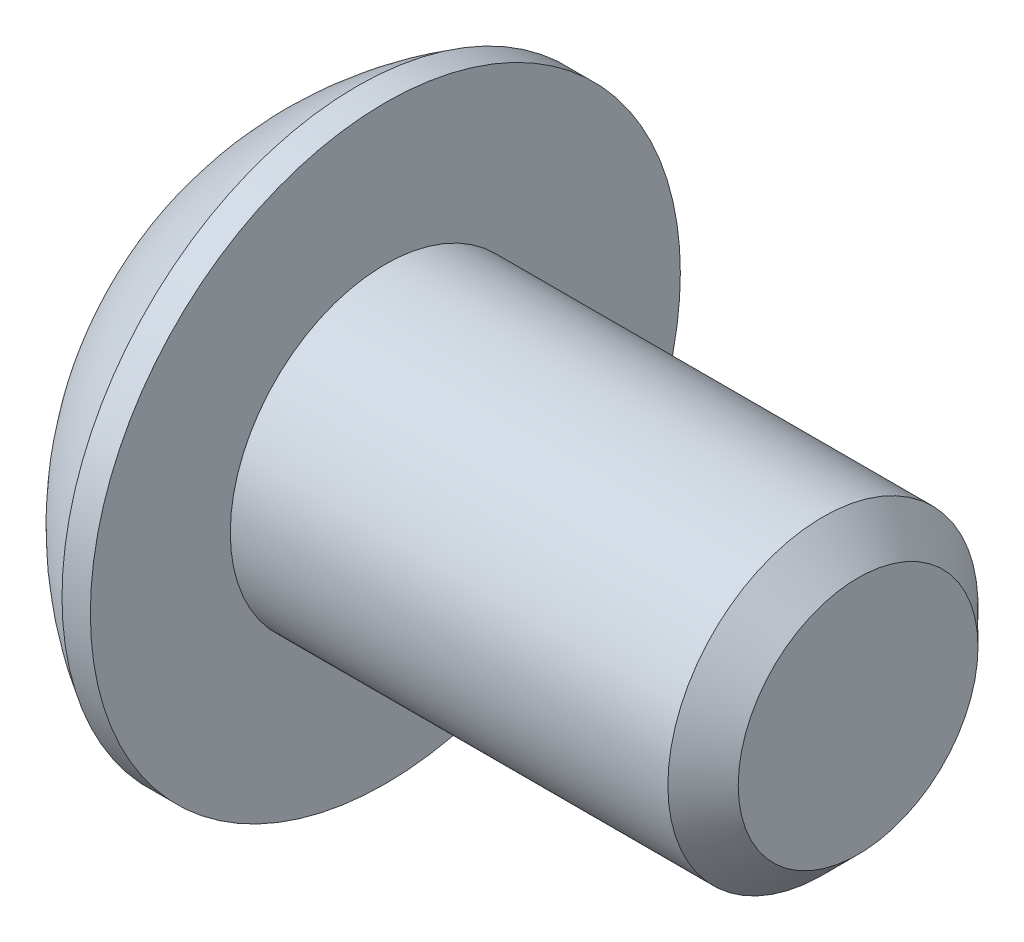
ISO-10303-21;
HEADER;
FILE_DESCRIPTION(('STEP AP214'),'2;1');
FILE_NAME('part.step','',(''),(''),'','','');
FILE_SCHEMA(('AUTOMOTIVE_DESIGN { 1 0 10303 214 1 1 1 1 }'));
ENDSEC;
DATA;
#1=APPLICATION_CONTEXT('core data for automotive mechanical design processes');
#2=APPLICATION_PROTOCOL_DEFINITION('international standard','automotive_design',2000,#1);
#3=PRODUCT_CONTEXT('',#1,'mechanical');
#4=PRODUCT('Part','Part','',(#3));
#5=PRODUCT_RELATED_PRODUCT_CATEGORY('part','',(#4));
#6=PRODUCT_DEFINITION_FORMATION('','',#4);
#7=PRODUCT_DEFINITION_CONTEXT('part definition',#1,'design');
#8=PRODUCT_DEFINITION('design','',#6,#7);
#9=PRODUCT_DEFINITION_SHAPE('','',#8);
#10=(LENGTH_UNIT() NAMED_UNIT(*) SI_UNIT(.MILLI.,.METRE.));
#11=(NAMED_UNIT(*) PLANE_ANGLE_UNIT() SI_UNIT($,.RADIAN.));
#12=(NAMED_UNIT(*) SI_UNIT($,.STERADIAN.) SOLID_ANGLE_UNIT());
#13=UNCERTAINTY_MEASURE_WITH_UNIT(LENGTH_MEASURE(1.E-05),#10,'distance_accuracy_value','');
#14=(GEOMETRIC_REPRESENTATION_CONTEXT(3) GLOBAL_UNCERTAINTY_ASSIGNED_CONTEXT((#13)) GLOBAL_UNIT_ASSIGNED_CONTEXT((#10,
#11,#12)) REPRESENTATION_CONTEXT('',''));
#15=CARTESIAN_POINT('',(0.,0.,0.));
#16=DIRECTION('',(0.,0.,1.));
#17=DIRECTION('',(1.,0.,0.));
#18=AXIS2_PLACEMENT_3D('',#15,#16,#17);
#19=CARTESIAN_POINT('',(8.5598,0.,0.));
#20=DIRECTION('',(-1.,0.,0.));
#21=DIRECTION('',(0.,0.,1.));
#22=AXIS2_PLACEMENT_3D('',#19,#20,#21);
#23=PLANE('',#22);
#24=CARTESIAN_POINT('',(8.55980000005729,0.,0.));
#25=DIRECTION('',(-1.,0.,0.));
#26=DIRECTION('',(0.,0.,1.));
#27=AXIS2_PLACEMENT_3D('',#24,#25,#26);
#28=CIRCLE('',#27,1.61035999997239);
#29=CARTESIAN_POINT('',(8.55980000005729,0.,1.61035999997239));
#30=VERTEX_POINT('',#29);
#31=EDGE_CURVE('E21',#30,#30,#28,.T.);
#32=ORIENTED_EDGE('',*,*,#31,.F.);
#33=EDGE_LOOP('',(#32));
#34=FACE_BOUND('',#33,.T.);
#35=ADVANCED_FACE('F17',(#34),#23,.F.);
#36=CARTESIAN_POINT('',(8.08736000004728,0.,0.));
#37=DIRECTION('',(-1.,0.,0.));
#38=DIRECTION('',(0.,0.,1.));
#39=AXIS2_PLACEMENT_3D('',#36,#37,#38);
#40=CONICAL_SURFACE('',#39,2.0827999999824,0.785398163397448);
#41=ORIENTED_EDGE('',*,*,#31,.T.);
#42=EDGE_LOOP('',(#41));
#43=FACE_BOUND('',#42,.T.);
#44=CARTESIAN_POINT('',(8.08736000000001,0.,0.));
#45=DIRECTION('',(-1.,0.,0.));
#46=DIRECTION('',(0.,0.,1.));
#47=AXIS2_PLACEMENT_3D('',#44,#45,#46);
#48=CIRCLE('',#47,2.0828);
#49=CARTESIAN_POINT('',(8.08736000000001,0.,2.0828));
#50=VERTEX_POINT('',#49);
#51=EDGE_CURVE('E109',#50,#50,#48,.T.);
#52=ORIENTED_EDGE('',*,*,#51,.F.);
#53=EDGE_LOOP('',(#52));
#54=FACE_BOUND('',#53,.T.);
#55=ADVANCED_FACE('F311',(#43,#54),#40,.T.);
#56=CARTESIAN_POINT('',(1.32079999997359,0.,0.));
#57=DIRECTION('',(-1.,0.,0.));
#58=DIRECTION('',(0.,0.,1.));
#59=AXIS2_PLACEMENT_3D('',#56,#57,#58);
#60=CONICAL_SURFACE('',#59,1.19380000001001,1.04719755119008);
#61=CARTESIAN_POINT('',(2.0100407513155,0.,0.));
#62=VERTEX_POINT('',#61);
#63=VERTEX_LOOP('',#62);
#64=FACE_BOUND('',#63,.T.);
#65=CARTESIAN_POINT('',(1.32079999997359,0.,0.));
#66=DIRECTION('',(-1.,0.,0.));
#67=DIRECTION('',(0.,0.,1.));
#68=AXIS2_PLACEMENT_3D('',#65,#66,#67);
#69=CIRCLE('',#68,1.19380000001001);
#70=CARTESIAN_POINT('',(1.32079999998682,-1.0338611270422,0.596900000002503));
#71=VERTEX_POINT('',#70);
#72=CARTESIAN_POINT('',(1.32079999998682,0.,1.19380000000501));
#73=VERTEX_POINT('',#72);
#74=EDGE_CURVE('E94',#71,#73,#69,.T.);
#75=ORIENTED_EDGE('',*,*,#74,.T.);
#76=CARTESIAN_POINT('',(1.32079999997359,0.,0.));
#77=DIRECTION('',(-1.,0.,0.));
#78=DIRECTION('',(0.,0.,1.));
#79=AXIS2_PLACEMENT_3D('',#76,#77,#78);
#80=CIRCLE('',#79,1.19380000001001);
#81=CARTESIAN_POINT('',(1.32079999998682,1.0338611270422,0.596900000002504));
#82=VERTEX_POINT('',#81);
#83=EDGE_CURVE('E88',#73,#82,#80,.T.);
#84=ORIENTED_EDGE('',*,*,#83,.T.);
#85=CARTESIAN_POINT('',(1.32079999997359,0.,0.));
#86=DIRECTION('',(-1.,0.,0.));
#87=DIRECTION('',(0.,0.,1.));
#88=AXIS2_PLACEMENT_3D('',#85,#86,#87);
#89=CIRCLE('',#88,1.19380000001001);
#90=CARTESIAN_POINT('',(1.32079999998682,1.0338611270422,-0.596900000002504));
#91=VERTEX_POINT('',#90);
#92=EDGE_CURVE('E91',#82,#91,#89,.T.);
#93=ORIENTED_EDGE('',*,*,#92,.T.);
#94=CARTESIAN_POINT('',(1.32079999997359,0.,0.));
#95=DIRECTION('',(-1.,0.,0.));
#96=DIRECTION('',(0.,0.,1.));
#97=AXIS2_PLACEMENT_3D('',#94,#95,#96);
#98=CIRCLE('',#97,1.19380000001001);
#99=CARTESIAN_POINT('',(1.32079999998682,1.49461108489558E-12,-1.19380000000501));
#100=VERTEX_POINT('',#99);
#101=EDGE_CURVE('E153',#91,#100,#98,.T.);
#102=ORIENTED_EDGE('',*,*,#101,.T.);
#103=CARTESIAN_POINT('',(1.32079999997359,0.,0.));
#104=DIRECTION('',(-1.,0.,0.));
#105=DIRECTION('',(0.,0.,1.));
#106=AXIS2_PLACEMENT_3D('',#103,#104,#105);
#107=CIRCLE('',#106,1.19380000001001);
#108=CARTESIAN_POINT('',(1.32079999998682,-1.0338611270422,-0.596900000002503));
#109=VERTEX_POINT('',#108);
#110=EDGE_CURVE('E155',#100,#109,#107,.T.);
#111=ORIENTED_EDGE('',*,*,#110,.T.);
#112=CARTESIAN_POINT('',(1.32079999997359,0.,0.));
#113=DIRECTION('',(-1.,0.,0.));
#114=DIRECTION('',(0.,0.,1.));
#115=AXIS2_PLACEMENT_3D('',#112,#113,#114);
#116=CIRCLE('',#115,1.19380000001001);
#117=EDGE_CURVE('E157',#109,#71,#116,.T.);
#118=ORIENTED_EDGE('',*,*,#117,.T.);
#119=EDGE_LOOP('',(#75,#84,#93,#102,#111,#118));
#120=FACE_BOUND('',#119,.T.);
#121=ADVANCED_FACE('F90',(#64,#120),#60,.F.);
#122=CARTESIAN_POINT('',(0.,0.,0.));
#123=DIRECTION('',(-1.,0.,0.));
#124=DIRECTION('',(0.,0.,1.));
#125=AXIS2_PLACEMENT_3D('',#122,#123,#124);
#126=CYLINDRICAL_SURFACE('',#125,2.0828);
#127=ORIENTED_EDGE('',*,*,#51,.T.);
#128=EDGE_LOOP('',(#127));
#129=FACE_BOUND('',#128,.T.);
#130=CARTESIAN_POINT('',(2.2098,0.,0.));
#131=DIRECTION('',(-1.,0.,0.));
#132=DIRECTION('',(0.,0.,1.));
#133=AXIS2_PLACEMENT_3D('',#130,#131,#132);
#134=CIRCLE('',#133,2.0828);
#135=CARTESIAN_POINT('',(2.2098,0.,2.0828));
#136=VERTEX_POINT('',#135);
#137=EDGE_CURVE('E150',#136,#136,#134,.F.);
#138=ORIENTED_EDGE('',*,*,#137,.T.);
#139=EDGE_LOOP('',(#138));
#140=FACE_BOUND('',#139,.T.);
#141=ADVANCED_FACE('F302',(#129,#140),#126,.T.);
#142=CARTESIAN_POINT('',(1.3208,-2.06772225407572,-1.1938));
#143=DIRECTION('',(1.,0.,0.));
#144=DIRECTION('',(0.,0.,-1.));
#145=AXIS2_PLACEMENT_3D('',#142,#143,#144);
#146=PLANE('',#145);
#147=DIRECTION('',(0.,-0.5,-0.866025403784439));
#148=VECTOR('',#147,1.);
#149=CARTESIAN_POINT('',(1.32080000000004,1.37848150271715,0.));
#150=LINE('',#149,#148);
#151=CARTESIAN_POINT('',(1.32080000000001,1.37848150271715,0.));
#152=VERTEX_POINT('',#151);
#153=EDGE_CURVE('E107',#91,#152,#150,.F.);
#154=ORIENTED_EDGE('',*,*,#153,.F.);
#155=ORIENTED_EDGE('',*,*,#92,.F.);
#156=DIRECTION('',(0.,0.5,-0.866025403784439));
#157=VECTOR('',#156,1.);
#158=CARTESIAN_POINT('',(1.3208,0.689240751358576,1.1938));
#159=LINE('',#158,#157);
#160=EDGE_CURVE('E105',#152,#82,#159,.F.);
#161=ORIENTED_EDGE('',*,*,#160,.F.);
#162=EDGE_LOOP('',(#154,#155,#161));
#163=FACE_BOUND('',#162,.T.);
#164=ADVANCED_FACE('F103',(#163),#146,.F.);
#165=CARTESIAN_POINT('',(1.3208,-2.06772225407572,-1.1938));
#166=DIRECTION('',(1.,0.,0.));
#167=DIRECTION('',(0.,0.,-1.));
#168=AXIS2_PLACEMENT_3D('',#165,#166,#167);
#169=PLANE('',#168);
#170=DIRECTION('',(0.,0.5,-0.866025403784439));
#171=VECTOR('',#170,1.);
#172=CARTESIAN_POINT('',(1.32080000000004,0.689240751358576,1.1938));
#173=LINE('',#172,#171);
#174=CARTESIAN_POINT('',(1.32080000000001,0.689240751358576,1.1938));
#175=VERTEX_POINT('',#174);
#176=EDGE_CURVE('E110',#82,#175,#173,.F.);
#177=ORIENTED_EDGE('',*,*,#176,.F.);
#178=ORIENTED_EDGE('',*,*,#83,.F.);
#179=DIRECTION('',(0.,1.,0.));
#180=VECTOR('',#179,1.);
#181=CARTESIAN_POINT('',(1.3208,-0.689240751358574,1.1938));
#182=LINE('',#181,#180);
#183=EDGE_CURVE('E113',#175,#73,#182,.F.);
#184=ORIENTED_EDGE('',*,*,#183,.F.);
#185=EDGE_LOOP('',(#177,#178,#184));
#186=FACE_BOUND('',#185,.T.);
#187=ADVANCED_FACE('F111',(#186),#169,.F.);
#188=CARTESIAN_POINT('',(1.3208,-2.06772225407572,-1.1938));
#189=DIRECTION('',(1.,0.,0.));
#190=DIRECTION('',(0.,0.,-1.));
#191=AXIS2_PLACEMENT_3D('',#188,#189,#190);
#192=PLANE('',#191);
#193=DIRECTION('',(0.,1.,0.));
#194=VECTOR('',#193,1.);
#195=CARTESIAN_POINT('',(1.32080000000004,-0.689240751358574,1.1938));
#196=LINE('',#195,#194);
#197=CARTESIAN_POINT('',(1.32080000000001,-0.689240751358574,1.1938));
#198=VERTEX_POINT('',#197);
#199=EDGE_CURVE('E171',#73,#198,#196,.F.);
#200=ORIENTED_EDGE('',*,*,#199,.F.);
#201=ORIENTED_EDGE('',*,*,#74,.F.);
#202=DIRECTION('',(0.,0.5,0.866025403784439));
#203=VECTOR('',#202,1.);
#204=CARTESIAN_POINT('',(1.3208,-1.37848150271715,0.));
#205=LINE('',#204,#203);
#206=EDGE_CURVE('E169',#198,#71,#205,.F.);
#207=ORIENTED_EDGE('',*,*,#206,.F.);
#208=EDGE_LOOP('',(#200,#201,#207));
#209=FACE_BOUND('',#208,.T.);
#210=ADVANCED_FACE('F167',(#209),#192,.F.);
#211=CARTESIAN_POINT('',(1.3208,-2.06772225407572,-1.1938));
#212=DIRECTION('',(1.,0.,0.));
#213=DIRECTION('',(0.,0.,-1.));
#214=AXIS2_PLACEMENT_3D('',#211,#212,#213);
#215=PLANE('',#214);
#216=DIRECTION('',(0.,0.5,0.866025403784439));
#217=VECTOR('',#216,1.);
#218=CARTESIAN_POINT('',(1.32080000000004,-1.37848150271715,0.));
#219=LINE('',#218,#217);
#220=CARTESIAN_POINT('',(1.32080000000001,-1.37848150271715,0.));
#221=VERTEX_POINT('',#220);
#222=EDGE_CURVE('E172',#71,#221,#219,.F.);
#223=ORIENTED_EDGE('',*,*,#222,.F.);
#224=ORIENTED_EDGE('',*,*,#117,.F.);
#225=DIRECTION('',(0.,-0.5,0.866025403784439));
#226=VECTOR('',#225,1.);
#227=CARTESIAN_POINT('',(1.3208,-0.689240751358574,-1.1938));
#228=LINE('',#227,#226);
#229=EDGE_CURVE('E175',#221,#109,#228,.F.);
#230=ORIENTED_EDGE('',*,*,#229,.F.);
#231=EDGE_LOOP('',(#223,#224,#230));
#232=FACE_BOUND('',#231,.T.);
#233=ADVANCED_FACE('F173',(#232),#215,.F.);
#234=CARTESIAN_POINT('',(1.3208,-2.06772225407572,-1.1938));
#235=DIRECTION('',(1.,0.,0.));
#236=DIRECTION('',(0.,0.,-1.));
#237=AXIS2_PLACEMENT_3D('',#234,#235,#236);
#238=PLANE('',#237);
#239=DIRECTION('',(0.,-0.5,0.866025403784439));
#240=VECTOR('',#239,1.);
#241=CARTESIAN_POINT('',(1.32080000000004,-0.689240751358574,-1.1938));
#242=LINE('',#241,#240);
#243=CARTESIAN_POINT('',(1.32080000000001,-0.689240751358574,-1.1938));
#244=VERTEX_POINT('',#243);
#245=EDGE_CURVE('E230',#109,#244,#242,.F.);
#246=ORIENTED_EDGE('',*,*,#245,.F.);
#247=ORIENTED_EDGE('',*,*,#110,.F.);
#248=DIRECTION('',(0.,1.,0.));
#249=VECTOR('',#248,1.);
#250=CARTESIAN_POINT('',(1.3208,0.689240751358577,-1.1938));
#251=LINE('',#250,#249);
#252=EDGE_CURVE('E242',#244,#100,#251,.T.);
#253=ORIENTED_EDGE('',*,*,#252,.F.);
#254=EDGE_LOOP('',(#246,#247,#253));
#255=FACE_BOUND('',#254,.T.);
#256=ADVANCED_FACE('F263',(#255),#238,.F.);
#257=CARTESIAN_POINT('',(1.3208,-2.06772225407572,-1.1938));
#258=DIRECTION('',(1.,0.,0.));
#259=DIRECTION('',(0.,0.,-1.));
#260=AXIS2_PLACEMENT_3D('',#257,#258,#259);
#261=PLANE('',#260);
#262=DIRECTION('',(0.,1.,0.));
#263=VECTOR('',#262,1.);
#264=CARTESIAN_POINT('',(1.32080000000004,0.689240751358577,-1.1938));
#265=LINE('',#264,#263);
#266=CARTESIAN_POINT('',(1.32080000000002,0.689240751358565,-1.19380000000002));
#267=VERTEX_POINT('',#266);
#268=EDGE_CURVE('E250',#100,#267,#265,.T.);
#269=ORIENTED_EDGE('',*,*,#268,.F.);
#270=ORIENTED_EDGE('',*,*,#101,.F.);
#271=DIRECTION('',(0.,-0.5,-0.866025403784439));
#272=VECTOR('',#271,1.);
#273=CARTESIAN_POINT('',(1.3208,1.37848150271715,0.));
#274=LINE('',#273,#272);
#275=EDGE_CURVE('E132',#267,#91,#274,.F.);
#276=ORIENTED_EDGE('',*,*,#275,.F.);
#277=EDGE_LOOP('',(#269,#270,#276));
#278=FACE_BOUND('',#277,.T.);
#279=ADVANCED_FACE('F265',(#278),#261,.F.);
#280=CARTESIAN_POINT('',(2.2098,2.0828,0.));
#281=DIRECTION('',(-1.,0.,0.));
#282=DIRECTION('',(0.,0.,1.));
#283=AXIS2_PLACEMENT_3D('',#280,#281,#282);
#284=PLANE('',#283);
#285=CARTESIAN_POINT('',(2.2098,0.,0.));
#286=DIRECTION('',(-1.,0.,0.));
#287=DIRECTION('',(0.,0.,1.));
#288=AXIS2_PLACEMENT_3D('',#285,#286,#287);
#289=CIRCLE('',#288,3.9624);
#290=CARTESIAN_POINT('',(2.2098,0.,3.9624));
#291=VERTEX_POINT('',#290);
#292=EDGE_CURVE('E139',#291,#291,#289,.T.);
#293=ORIENTED_EDGE('',*,*,#292,.F.);
#294=EDGE_LOOP('',(#293));
#295=FACE_BOUND('',#294,.T.);
#296=ORIENTED_EDGE('',*,*,#137,.F.);
#297=EDGE_LOOP('',(#296));
#298=FACE_BOUND('',#297,.T.);
#299=ADVANCED_FACE('F296',(#295,#298),#284,.F.);
#300=CARTESIAN_POINT('',(1.3208,1.37848150271715,0.));
#301=DIRECTION('',(0.,-0.866025403784439,0.5));
#302=DIRECTION('',(0.,-0.5,-0.866025403784439));
#303=AXIS2_PLACEMENT_3D('',#300,#301,#302);
#304=PLANE('',#303);
#305=ORIENTED_EDGE('',*,*,#153,.T.);
#306=DIRECTION('',(1.,0.,0.));
#307=VECTOR('',#306,1.);
#308=CARTESIAN_POINT('',(1.3208,1.37848150271715,0.));
#309=LINE('',#308,#307);
#310=CARTESIAN_POINT('',(0.,1.37848150271715,0.));
#311=VERTEX_POINT('',#310);
#312=EDGE_CURVE('E120',#311,#152,#309,.T.);
#313=ORIENTED_EDGE('',*,*,#312,.F.);
#314=DIRECTION('',(0.,0.5,0.866025403784439));
#315=VECTOR('',#314,1.);
#316=CARTESIAN_POINT('',(0.,0.689240751358577,-1.1938));
#317=LINE('',#316,#315);
#318=CARTESIAN_POINT('',(0.,0.689240751358577,-1.1938));
#319=VERTEX_POINT('',#318);
#320=EDGE_CURVE('E135',#319,#311,#317,.T.);
#321=ORIENTED_EDGE('',*,*,#320,.F.);
#322=DIRECTION('',(1.,0.,0.));
#323=VECTOR('',#322,1.);
#324=CARTESIAN_POINT('',(1.3208,0.689240751358577,-1.1938));
#325=LINE('',#324,#323);
#326=EDGE_CURVE('E149',#267,#319,#325,.F.);
#327=ORIENTED_EDGE('',*,*,#326,.F.);
#328=ORIENTED_EDGE('',*,*,#275,.T.);
#329=EDGE_LOOP('',(#305,#313,#321,#327,#328));
#330=FACE_BOUND('',#329,.T.);
#331=ADVANCED_FACE('F268',(#330),#304,.T.);
#332=CARTESIAN_POINT('',(1.3208,0.689240751358576,1.1938));
#333=DIRECTION('',(0.,-0.866025403784439,-0.5));
#334=DIRECTION('',(0.,0.5,-0.866025403784439));
#335=AXIS2_PLACEMENT_3D('',#332,#333,#334);
#336=PLANE('',#335);
#337=ORIENTED_EDGE('',*,*,#176,.T.);
#338=DIRECTION('',(1.,0.,0.));
#339=VECTOR('',#338,1.);
#340=CARTESIAN_POINT('',(1.3208,0.689240751358576,1.1938));
#341=LINE('',#340,#339);
#342=CARTESIAN_POINT('',(0.,0.689240751358577,1.1938));
#343=VERTEX_POINT('',#342);
#344=EDGE_CURVE('E116',#343,#175,#341,.T.);
#345=ORIENTED_EDGE('',*,*,#344,.F.);
#346=DIRECTION('',(0.,-0.5,0.866025403784439));
#347=VECTOR('',#346,1.);
#348=CARTESIAN_POINT('',(0.,1.37848150271715,0.));
#349=LINE('',#348,#347);
#350=EDGE_CURVE('E138',#311,#343,#349,.T.);
#351=ORIENTED_EDGE('',*,*,#350,.F.);
#352=ORIENTED_EDGE('',*,*,#312,.T.);
#353=ORIENTED_EDGE('',*,*,#160,.T.);
#354=EDGE_LOOP('',(#337,#345,#351,#352,#353));
#355=FACE_BOUND('',#354,.T.);
#356=ADVANCED_FACE('F118',(#355),#336,.T.);
#357=CARTESIAN_POINT('',(1.3208,-0.689240751358574,1.1938));
#358=DIRECTION('',(0.,0.,-1.));
#359=DIRECTION('',(0.,1.,0.));
#360=AXIS2_PLACEMENT_3D('',#357,#358,#359);
#361=PLANE('',#360);
#362=ORIENTED_EDGE('',*,*,#199,.T.);
#363=DIRECTION('',(1.,0.,0.));
#364=VECTOR('',#363,1.);
#365=CARTESIAN_POINT('',(1.3208,-0.689240751358574,1.1938));
#366=LINE('',#365,#364);
#367=CARTESIAN_POINT('',(0.,-0.689240751358574,1.1938));
#368=VERTEX_POINT('',#367);
#369=EDGE_CURVE('E182',#368,#198,#366,.T.);
#370=ORIENTED_EDGE('',*,*,#369,.F.);
#371=DIRECTION('',(0.,1.,0.));
#372=VECTOR('',#371,1.);
#373=CARTESIAN_POINT('',(0.,0.,1.1938));
#374=LINE('',#373,#372);
#375=EDGE_CURVE('E196',#343,#368,#374,.F.);
#376=ORIENTED_EDGE('',*,*,#375,.F.);
#377=ORIENTED_EDGE('',*,*,#344,.T.);
#378=ORIENTED_EDGE('',*,*,#183,.T.);
#379=EDGE_LOOP('',(#362,#370,#376,#377,#378));
#380=FACE_BOUND('',#379,.T.);
#381=ADVANCED_FACE('F218',(#380),#361,.T.);
#382=CARTESIAN_POINT('',(1.3208,-1.37848150271715,0.));
#383=DIRECTION('',(0.,0.866025403784439,-0.5));
#384=DIRECTION('',(0.,0.5,0.866025403784439));
#385=AXIS2_PLACEMENT_3D('',#382,#383,#384);
#386=PLANE('',#385);
#387=ORIENTED_EDGE('',*,*,#222,.T.);
#388=DIRECTION('',(1.,0.,0.));
#389=VECTOR('',#388,1.);
#390=CARTESIAN_POINT('',(1.3208,-1.37848150271715,0.));
#391=LINE('',#390,#389);
#392=CARTESIAN_POINT('',(0.,-1.37848150271715,0.));
#393=VERTEX_POINT('',#392);
#394=EDGE_CURVE('E178',#393,#221,#391,.T.);
#395=ORIENTED_EDGE('',*,*,#394,.F.);
#396=DIRECTION('',(0.,-0.5,-0.866025403784439));
#397=VECTOR('',#396,1.);
#398=CARTESIAN_POINT('',(0.,-0.689240751358574,1.1938));
#399=LINE('',#398,#397);
#400=EDGE_CURVE('E199',#368,#393,#399,.T.);
#401=ORIENTED_EDGE('',*,*,#400,.F.);
#402=ORIENTED_EDGE('',*,*,#369,.T.);
#403=ORIENTED_EDGE('',*,*,#206,.T.);
#404=EDGE_LOOP('',(#387,#395,#401,#402,#403));
#405=FACE_BOUND('',#404,.T.);
#406=ADVANCED_FACE('F180',(#405),#386,.T.);
#407=CARTESIAN_POINT('',(1.3208,-0.689240751358574,-1.1938));
#408=DIRECTION('',(0.,0.866025403784439,0.5));
#409=DIRECTION('',(0.,-0.5,0.866025403784439));
#410=AXIS2_PLACEMENT_3D('',#407,#408,#409);
#411=PLANE('',#410);
#412=ORIENTED_EDGE('',*,*,#245,.T.);
#413=DIRECTION('',(1.,0.,0.));
#414=VECTOR('',#413,1.);
#415=CARTESIAN_POINT('',(1.3208,-0.689240751358574,-1.1938));
#416=LINE('',#415,#414);
#417=CARTESIAN_POINT('',(0.,-0.689240751358574,-1.1938));
#418=VERTEX_POINT('',#417);
#419=EDGE_CURVE('E36',#418,#244,#416,.T.);
#420=ORIENTED_EDGE('',*,*,#419,.F.);
#421=DIRECTION('',(0.,0.5,-0.866025403784439));
#422=VECTOR('',#421,1.);
#423=CARTESIAN_POINT('',(0.,-1.37848150271715,0.));
#424=LINE('',#423,#422);
#425=EDGE_CURVE('E219',#393,#418,#424,.T.);
#426=ORIENTED_EDGE('',*,*,#425,.F.);
#427=ORIENTED_EDGE('',*,*,#394,.T.);
#428=ORIENTED_EDGE('',*,*,#229,.T.);
#429=EDGE_LOOP('',(#412,#420,#426,#427,#428));
#430=FACE_BOUND('',#429,.T.);
#431=ADVANCED_FACE('F269',(#430),#411,.T.);
#432=CARTESIAN_POINT('',(1.3208,0.689240751358577,-1.1938));
#433=DIRECTION('',(0.,0.,1.));
#434=DIRECTION('',(1.,0.,0.));
#435=AXIS2_PLACEMENT_3D('',#432,#433,#434);
#436=PLANE('',#435);
#437=ORIENTED_EDGE('',*,*,#268,.T.);
#438=ORIENTED_EDGE('',*,*,#326,.T.);
#439=DIRECTION('',(0.,1.,0.));
#440=VECTOR('',#439,1.);
#441=CARTESIAN_POINT('',(0.,0.,-1.1938));
#442=LINE('',#441,#440);
#443=EDGE_CURVE('E146',#418,#319,#442,.T.);
#444=ORIENTED_EDGE('',*,*,#443,.F.);
#445=ORIENTED_EDGE('',*,*,#419,.T.);
#446=ORIENTED_EDGE('',*,*,#252,.T.);
#447=EDGE_LOOP('',(#437,#438,#444,#445,#446));
#448=FACE_BOUND('',#447,.T.);
#449=ADVANCED_FACE('F260',(#448),#436,.T.);
#450=CARTESIAN_POINT('',(0.,0.,0.));
#451=DIRECTION('',(-1.,0.,0.));
#452=DIRECTION('',(0.,0.,1.));
#453=AXIS2_PLACEMENT_3D('',#450,#451,#452);
#454=CYLINDRICAL_SURFACE('',#453,3.9624);
#455=CARTESIAN_POINT('',(1.8288,0.,0.));
#456=DIRECTION('',(-1.,0.,0.));
#457=DIRECTION('',(0.,0.,1.));
#458=AXIS2_PLACEMENT_3D('',#455,#456,#457);
#459=CIRCLE('',#458,3.9624);
#460=CARTESIAN_POINT('',(1.8288,0.,3.9624));
#461=VERTEX_POINT('',#460);
#462=EDGE_CURVE('E27',#461,#461,#459,.T.);
#463=ORIENTED_EDGE('',*,*,#462,.F.);
#464=EDGE_LOOP('',(#463));
#465=FACE_BOUND('',#464,.T.);
#466=ORIENTED_EDGE('',*,*,#292,.T.);
#467=EDGE_LOOP('',(#466));
#468=FACE_BOUND('',#467,.T.);
#469=ADVANCED_FACE('F277',(#465,#468),#454,.T.);
#470=CARTESIAN_POINT('',(0.,0.,0.));
#471=DIRECTION('',(-1.,0.,0.));
#472=DIRECTION('',(0.,0.,1.));
#473=AXIS2_PLACEMENT_3D('',#470,#471,#472);
#474=PLANE('',#473);
#475=CARTESIAN_POINT('',(0.,0.,0.));
#476=DIRECTION('',(-1.,0.,0.));
#477=DIRECTION('',(0.,0.,1.));
#478=AXIS2_PLACEMENT_3D('',#475,#476,#477);
#479=CIRCLE('',#478,1.9812);
#480=CARTESIAN_POINT('',(0.,0.,1.9812));
#481=VERTEX_POINT('',#480);
#482=EDGE_CURVE('E11',#481,#481,#479,.F.);
#483=ORIENTED_EDGE('',*,*,#482,.F.);
#484=EDGE_LOOP('',(#483));
#485=FACE_BOUND('',#484,.T.);
#486=ORIENTED_EDGE('',*,*,#425,.T.);
#487=ORIENTED_EDGE('',*,*,#443,.T.);
#488=ORIENTED_EDGE('',*,*,#320,.T.);
#489=ORIENTED_EDGE('',*,*,#350,.T.);
#490=ORIENTED_EDGE('',*,*,#375,.T.);
#491=ORIENTED_EDGE('',*,*,#400,.T.);
#492=EDGE_LOOP('',(#486,#487,#488,#489,#490,#491));
#493=FACE_BOUND('',#492,.T.);
#494=ADVANCED_FACE('F212',(#485,#493),#474,.T.);
#495=CARTESIAN_POINT('',(4.13385,0.,0.));
#496=DIRECTION('',(0.,1.,0.));
#497=DIRECTION('',(-0.489667403954941,0.,-0.87190930348519));
#498=AXIS2_PLACEMENT_3D('',#495,#496,#497);
#499=SPHERICAL_SURFACE('',#498,4.58408870578439);
#500=CARTESIAN_POINT('',(4.13385,0.,0.));
#501=DIRECTION('',(-1.,0.,0.));
#502=DIRECTION('',(0.,0.,1.));
#503=AXIS2_PLACEMENT_3D('',#500,#501,#502);
#504=SPHERICAL_SURFACE('',#503,4.58408870578439);
#505=ORIENTED_EDGE('',*,*,#482,.T.);
#506=EDGE_LOOP('',(#505));
#507=FACE_BOUND('',#506,.T.);
#508=ORIENTED_EDGE('',*,*,#462,.T.);
#509=EDGE_LOOP('',(#508));
#510=FACE_BOUND('',#509,.T.);
#511=ADVANCED_FACE('F19',(#507,#510),#504,.T.);
#512=CLOSED_SHELL('',(#35,#55,#121,#141,#164,#187,#210,#233,#256,#279,#299,#331,#356,#381,#406,
#431,#449,#469,#494,#511));
#513=MANIFOLD_SOLID_BREP('B1',#512);
#514=ADVANCED_BREP_SHAPE_REPRESENTATION('',(#18,#513),#14);
#515=SHAPE_DEFINITION_REPRESENTATION(#9,#514);
ENDSEC;
END-ISO-10303-21;
